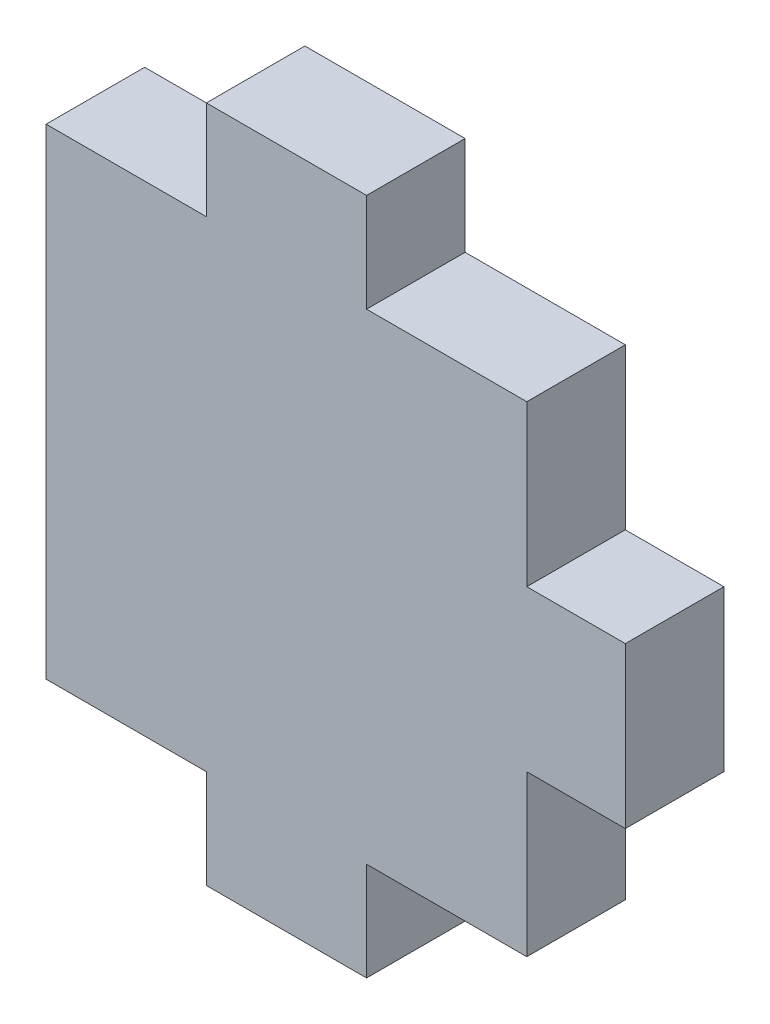
ISO-10303-21;
HEADER;
FILE_DESCRIPTION(('STEP AP214'),'2;1');
FILE_NAME('part.step','',(''),(''),'','','');
FILE_SCHEMA(('AUTOMOTIVE_DESIGN { 1 0 10303 214 1 1 1 1 }'));
ENDSEC;
DATA;
#1=APPLICATION_CONTEXT('core data for automotive mechanical design processes');
#2=APPLICATION_PROTOCOL_DEFINITION('international standard','automotive_design',2000,#1);
#3=PRODUCT_CONTEXT('',#1,'mechanical');
#4=PRODUCT('Part','Part','',(#3));
#5=PRODUCT_RELATED_PRODUCT_CATEGORY('part','',(#4));
#6=PRODUCT_DEFINITION_FORMATION('','',#4);
#7=PRODUCT_DEFINITION_CONTEXT('part definition',#1,'design');
#8=PRODUCT_DEFINITION('design','',#6,#7);
#9=PRODUCT_DEFINITION_SHAPE('','',#8);
#10=(LENGTH_UNIT() NAMED_UNIT(*) SI_UNIT(.MILLI.,.METRE.));
#11=(NAMED_UNIT(*) PLANE_ANGLE_UNIT() SI_UNIT($,.RADIAN.));
#12=(NAMED_UNIT(*) SI_UNIT($,.STERADIAN.) SOLID_ANGLE_UNIT());
#13=UNCERTAINTY_MEASURE_WITH_UNIT(LENGTH_MEASURE(1.E-05),#10,'distance_accuracy_value','');
#14=(GEOMETRIC_REPRESENTATION_CONTEXT(3) GLOBAL_UNCERTAINTY_ASSIGNED_CONTEXT((#13)) GLOBAL_UNIT_ASSIGNED_CONTEXT((#10,
#11,#12)) REPRESENTATION_CONTEXT('',''));
#15=CARTESIAN_POINT('',(0.,0.,0.));
#16=DIRECTION('',(0.,0.,1.));
#17=DIRECTION('',(1.,0.,0.));
#18=AXIS2_PLACEMENT_3D('',#15,#16,#17);
#19=CARTESIAN_POINT('',(-6.14718494021936,17.5053669527158,5.207));
#20=DIRECTION('',(1.,0.,0.));
#21=DIRECTION('',(0.,0.,-1.));
#22=AXIS2_PLACEMENT_3D('',#19,#20,#21);
#23=PLANE('',#22);
#24=DIRECTION('',(0.,-1.,0.));
#25=VECTOR('',#24,1.);
#26=CARTESIAN_POINT('',(-6.14718494021936,17.5053669527158,0.));
#27=LINE('',#26,#25);
#28=CARTESIAN_POINT('',(-6.14718494021936,17.5053669527158,0.));
#29=VERTEX_POINT('',#28);
#30=CARTESIAN_POINT('',(-6.14718494021936,-7.89463304728425,0.));
#31=VERTEX_POINT('',#30);
#32=EDGE_CURVE('E176',#29,#31,#27,.T.);
#33=ORIENTED_EDGE('',*,*,#32,.T.);
#34=DIRECTION('',(0.,0.,-1.));
#35=VECTOR('',#34,1.);
#36=CARTESIAN_POINT('',(-6.14718494021936,-7.89463304728425,5.207));
#37=LINE('',#36,#35);
#38=CARTESIAN_POINT('',(-6.14718494021936,-7.89463304728425,5.207));
#39=VERTEX_POINT('',#38);
#40=EDGE_CURVE('E11',#39,#31,#37,.T.);
#41=ORIENTED_EDGE('',*,*,#40,.F.);
#42=DIRECTION('',(0.,-1.,0.));
#43=VECTOR('',#42,1.);
#44=CARTESIAN_POINT('',(-6.14718494021936,17.5053669527158,5.207));
#45=LINE('',#44,#43);
#46=CARTESIAN_POINT('',(-6.14718494021936,17.5053669527158,5.207));
#47=VERTEX_POINT('',#46);
#48=EDGE_CURVE('E206',#47,#39,#45,.T.);
#49=ORIENTED_EDGE('',*,*,#48,.F.);
#50=DIRECTION('',(0.,0.,-1.));
#51=VECTOR('',#50,1.);
#52=CARTESIAN_POINT('',(-6.14718494021936,17.5053669527158,5.207));
#53=LINE('',#52,#51);
#54=EDGE_CURVE('E172',#47,#29,#53,.T.);
#55=ORIENTED_EDGE('',*,*,#54,.T.);
#56=EDGE_LOOP('',(#33,#41,#49,#55));
#57=FACE_BOUND('',#56,.T.);
#58=ADVANCED_FACE('F32',(#57),#23,.F.);
#59=CARTESIAN_POINT('',(-6.14718494021936,-7.89463304728425,5.207));
#60=DIRECTION('',(0.,1.,0.));
#61=DIRECTION('',(0.,0.,1.));
#62=AXIS2_PLACEMENT_3D('',#59,#60,#61);
#63=PLANE('',#62);
#64=DIRECTION('',(1.,0.,0.));
#65=VECTOR('',#64,1.);
#66=CARTESIAN_POINT('',(-6.14718494021936,-7.89463304728425,0.));
#67=LINE('',#66,#65);
#68=CARTESIAN_POINT('',(2.3194817264473,-7.89463304728425,0.));
#69=VERTEX_POINT('',#68);
#70=EDGE_CURVE('E179',#31,#69,#67,.T.);
#71=ORIENTED_EDGE('',*,*,#70,.T.);
#72=DIRECTION('',(0.,0.,-1.));
#73=VECTOR('',#72,1.);
#74=CARTESIAN_POINT('',(2.3194817264473,-7.89463304728425,5.207));
#75=LINE('',#74,#73);
#76=CARTESIAN_POINT('',(2.3194817264473,-7.89463304728425,5.207));
#77=VERTEX_POINT('',#76);
#78=EDGE_CURVE('E40',#77,#69,#75,.T.);
#79=ORIENTED_EDGE('',*,*,#78,.F.);
#80=DIRECTION('',(1.,0.,0.));
#81=VECTOR('',#80,1.);
#82=CARTESIAN_POINT('',(-6.14718494021936,-7.89463304728425,5.207));
#83=LINE('',#82,#81);
#84=EDGE_CURVE('E115',#39,#77,#83,.T.);
#85=ORIENTED_EDGE('',*,*,#84,.F.);
#86=ORIENTED_EDGE('',*,*,#40,.T.);
#87=EDGE_LOOP('',(#71,#79,#85,#86));
#88=FACE_BOUND('',#87,.T.);
#89=ADVANCED_FACE('F304',(#88),#63,.F.);
#90=CARTESIAN_POINT('',(2.3194817264473,-7.89463304728425,5.207));
#91=DIRECTION('',(1.,0.,0.));
#92=DIRECTION('',(0.,1.,0.));
#93=AXIS2_PLACEMENT_3D('',#90,#91,#92);
#94=PLANE('',#93);
#95=DIRECTION('',(0.,-1.,0.));
#96=VECTOR('',#95,1.);
#97=CARTESIAN_POINT('',(2.3194817264473,-7.89463304728425,0.));
#98=LINE('',#97,#96);
#99=CARTESIAN_POINT('',(2.3194817264473,-13.1016330472842,0.));
#100=VERTEX_POINT('',#99);
#101=EDGE_CURVE('E181',#69,#100,#98,.T.);
#102=ORIENTED_EDGE('',*,*,#101,.T.);
#103=DIRECTION('',(0.,0.,-1.));
#104=VECTOR('',#103,1.);
#105=CARTESIAN_POINT('',(2.3194817264473,-13.1016330472842,5.207));
#106=LINE('',#105,#104);
#107=CARTESIAN_POINT('',(2.3194817264473,-13.1016330472842,5.207));
#108=VERTEX_POINT('',#107);
#109=EDGE_CURVE('E237',#108,#100,#106,.T.);
#110=ORIENTED_EDGE('',*,*,#109,.F.);
#111=DIRECTION('',(0.,-1.,0.));
#112=VECTOR('',#111,1.);
#113=CARTESIAN_POINT('',(2.3194817264473,-7.89463304728425,5.207));
#114=LINE('',#113,#112);
#115=EDGE_CURVE('E245',#77,#108,#114,.T.);
#116=ORIENTED_EDGE('',*,*,#115,.F.);
#117=ORIENTED_EDGE('',*,*,#78,.T.);
#118=EDGE_LOOP('',(#102,#110,#116,#117));
#119=FACE_BOUND('',#118,.T.);
#120=ADVANCED_FACE('F243',(#119),#94,.F.);
#121=CARTESIAN_POINT('',(2.3194817264473,-13.1016330472842,5.207));
#122=DIRECTION('',(0.,1.,0.));
#123=DIRECTION('',(0.,0.,1.));
#124=AXIS2_PLACEMENT_3D('',#121,#122,#123);
#125=PLANE('',#124);
#126=DIRECTION('',(1.,0.,0.));
#127=VECTOR('',#126,1.);
#128=CARTESIAN_POINT('',(2.3194817264473,-13.1016330472842,0.));
#129=LINE('',#128,#127);
#130=CARTESIAN_POINT('',(10.786148393114,-13.1016330472842,0.));
#131=VERTEX_POINT('',#130);
#132=EDGE_CURVE('E183',#100,#131,#129,.T.);
#133=ORIENTED_EDGE('',*,*,#132,.T.);
#134=DIRECTION('',(0.,0.,-1.));
#135=VECTOR('',#134,1.);
#136=CARTESIAN_POINT('',(10.786148393114,-13.1016330472842,5.207));
#137=LINE('',#136,#135);
#138=CARTESIAN_POINT('',(10.786148393114,-13.1016330472842,5.207));
#139=VERTEX_POINT('',#138);
#140=EDGE_CURVE('E234',#139,#131,#137,.T.);
#141=ORIENTED_EDGE('',*,*,#140,.F.);
#142=DIRECTION('',(1.,0.,0.));
#143=VECTOR('',#142,1.);
#144=CARTESIAN_POINT('',(2.3194817264473,-13.1016330472842,5.207));
#145=LINE('',#144,#143);
#146=EDGE_CURVE('E263',#108,#139,#145,.T.);
#147=ORIENTED_EDGE('',*,*,#146,.F.);
#148=ORIENTED_EDGE('',*,*,#109,.T.);
#149=EDGE_LOOP('',(#133,#141,#147,#148));
#150=FACE_BOUND('',#149,.T.);
#151=ADVANCED_FACE('F254',(#150),#125,.F.);
#152=CARTESIAN_POINT('',(10.786148393114,-7.89463304728425,5.207));
#153=DIRECTION('',(-1.,0.,0.));
#154=DIRECTION('',(0.,-1.,0.));
#155=AXIS2_PLACEMENT_3D('',#152,#153,#154);
#156=PLANE('',#155);
#157=DIRECTION('',(0.,1.,0.));
#158=VECTOR('',#157,1.);
#159=CARTESIAN_POINT('',(10.786148393114,-7.89463304728425,0.));
#160=LINE('',#159,#158);
#161=CARTESIAN_POINT('',(10.786148393114,-7.89463304728425,0.));
#162=VERTEX_POINT('',#161);
#163=EDGE_CURVE('E185',#131,#162,#160,.T.);
#164=ORIENTED_EDGE('',*,*,#163,.T.);
#165=DIRECTION('',(0.,0.,-1.));
#166=VECTOR('',#165,1.);
#167=CARTESIAN_POINT('',(10.786148393114,-7.89463304728425,5.207));
#168=LINE('',#167,#166);
#169=CARTESIAN_POINT('',(10.786148393114,-7.89463304728425,5.207));
#170=VERTEX_POINT('',#169);
#171=EDGE_CURVE('E231',#170,#162,#168,.T.);
#172=ORIENTED_EDGE('',*,*,#171,.F.);
#173=DIRECTION('',(0.,1.,0.));
#174=VECTOR('',#173,1.);
#175=CARTESIAN_POINT('',(10.786148393114,-7.89463304728425,5.207));
#176=LINE('',#175,#174);
#177=EDGE_CURVE('E260',#139,#170,#176,.T.);
#178=ORIENTED_EDGE('',*,*,#177,.F.);
#179=ORIENTED_EDGE('',*,*,#140,.T.);
#180=EDGE_LOOP('',(#164,#172,#178,#179));
#181=FACE_BOUND('',#180,.T.);
#182=ADVANCED_FACE('F258',(#181),#156,.F.);
#183=CARTESIAN_POINT('',(10.786148393114,-7.89463304728425,5.207));
#184=DIRECTION('',(0.,1.,0.));
#185=DIRECTION('',(0.,0.,1.));
#186=AXIS2_PLACEMENT_3D('',#183,#184,#185);
#187=PLANE('',#186);
#188=DIRECTION('',(1.,0.,0.));
#189=VECTOR('',#188,1.);
#190=CARTESIAN_POINT('',(10.786148393114,-7.89463304728425,0.));
#191=LINE('',#190,#189);
#192=CARTESIAN_POINT('',(19.2528150597806,-7.89463304728425,0.));
#193=VERTEX_POINT('',#192);
#194=EDGE_CURVE('E187',#162,#193,#191,.T.);
#195=ORIENTED_EDGE('',*,*,#194,.T.);
#196=DIRECTION('',(0.,0.,-1.));
#197=VECTOR('',#196,1.);
#198=CARTESIAN_POINT('',(19.2528150597806,-7.89463304728425,5.207));
#199=LINE('',#198,#197);
#200=CARTESIAN_POINT('',(19.2528150597806,-7.89463304728425,5.207));
#201=VERTEX_POINT('',#200);
#202=EDGE_CURVE('E228',#201,#193,#199,.T.);
#203=ORIENTED_EDGE('',*,*,#202,.F.);
#204=DIRECTION('',(1.,0.,0.));
#205=VECTOR('',#204,1.);
#206=CARTESIAN_POINT('',(10.786148393114,-7.89463304728425,5.207));
#207=LINE('',#206,#205);
#208=EDGE_CURVE('E262',#170,#201,#207,.T.);
#209=ORIENTED_EDGE('',*,*,#208,.F.);
#210=ORIENTED_EDGE('',*,*,#171,.T.);
#211=EDGE_LOOP('',(#195,#203,#209,#210));
#212=FACE_BOUND('',#211,.T.);
#213=ADVANCED_FACE('F317',(#212),#187,.F.);
#214=CARTESIAN_POINT('',(19.2528150597806,0.572033619382422,5.207));
#215=DIRECTION('',(-1.,0.,0.));
#216=DIRECTION('',(0.,0.,1.));
#217=AXIS2_PLACEMENT_3D('',#214,#215,#216);
#218=PLANE('',#217);
#219=DIRECTION('',(0.,1.,0.));
#220=VECTOR('',#219,1.);
#221=CARTESIAN_POINT('',(19.2528150597806,0.572033619382422,0.));
#222=LINE('',#221,#220);
#223=CARTESIAN_POINT('',(19.2528150597806,0.572033619382422,0.));
#224=VERTEX_POINT('',#223);
#225=EDGE_CURVE('E189',#193,#224,#222,.T.);
#226=ORIENTED_EDGE('',*,*,#225,.T.);
#227=DIRECTION('',(0.,0.,-1.));
#228=VECTOR('',#227,1.);
#229=CARTESIAN_POINT('',(19.2528150597806,0.572033619382422,5.207));
#230=LINE('',#229,#228);
#231=CARTESIAN_POINT('',(19.2528150597806,0.572033619382422,5.207));
#232=VERTEX_POINT('',#231);
#233=EDGE_CURVE('E225',#232,#224,#230,.T.);
#234=ORIENTED_EDGE('',*,*,#233,.F.);
#235=DIRECTION('',(0.,1.,0.));
#236=VECTOR('',#235,1.);
#237=CARTESIAN_POINT('',(19.2528150597806,0.572033619382422,5.207));
#238=LINE('',#237,#236);
#239=EDGE_CURVE('E265',#201,#232,#238,.T.);
#240=ORIENTED_EDGE('',*,*,#239,.F.);
#241=ORIENTED_EDGE('',*,*,#202,.T.);
#242=EDGE_LOOP('',(#226,#234,#240,#241));
#243=FACE_BOUND('',#242,.T.);
#244=ADVANCED_FACE('F320',(#243),#218,.F.);
#245=CARTESIAN_POINT('',(19.2528150597806,0.572033619382422,5.207));
#246=DIRECTION('',(0.,1.,0.));
#247=DIRECTION('',(0.,0.,1.));
#248=AXIS2_PLACEMENT_3D('',#245,#246,#247);
#249=PLANE('',#248);
#250=DIRECTION('',(1.,0.,0.));
#251=VECTOR('',#250,1.);
#252=CARTESIAN_POINT('',(19.2528150597806,0.572033619382422,0.));
#253=LINE('',#252,#251);
#254=CARTESIAN_POINT('',(24.4598150597806,0.572033619382422,0.));
#255=VERTEX_POINT('',#254);
#256=EDGE_CURVE('E191',#224,#255,#253,.T.);
#257=ORIENTED_EDGE('',*,*,#256,.T.);
#258=DIRECTION('',(0.,0.,-1.));
#259=VECTOR('',#258,1.);
#260=CARTESIAN_POINT('',(24.4598150597806,0.572033619382422,5.207));
#261=LINE('',#260,#259);
#262=CARTESIAN_POINT('',(24.4598150597806,0.572033619382422,5.207));
#263=VERTEX_POINT('',#262);
#264=EDGE_CURVE('E222',#263,#255,#261,.T.);
#265=ORIENTED_EDGE('',*,*,#264,.F.);
#266=DIRECTION('',(1.,0.,0.));
#267=VECTOR('',#266,1.);
#268=CARTESIAN_POINT('',(19.2528150597806,0.572033619382422,5.207));
#269=LINE('',#268,#267);
#270=EDGE_CURVE('E271',#232,#263,#269,.T.);
#271=ORIENTED_EDGE('',*,*,#270,.F.);
#272=ORIENTED_EDGE('',*,*,#233,.T.);
#273=EDGE_LOOP('',(#257,#265,#271,#272));
#274=FACE_BOUND('',#273,.T.);
#275=ADVANCED_FACE('F324',(#274),#249,.F.);
#276=CARTESIAN_POINT('',(24.4598150597806,9.03870028604909,5.207));
#277=DIRECTION('',(-1.,0.,0.));
#278=DIRECTION('',(0.,0.,1.));
#279=AXIS2_PLACEMENT_3D('',#276,#277,#278);
#280=PLANE('',#279);
#281=DIRECTION('',(0.,1.,0.));
#282=VECTOR('',#281,1.);
#283=CARTESIAN_POINT('',(24.4598150597806,9.03870028604909,0.));
#284=LINE('',#283,#282);
#285=CARTESIAN_POINT('',(24.4598150597806,9.03870028604909,0.));
#286=VERTEX_POINT('',#285);
#287=EDGE_CURVE('E193',#255,#286,#284,.T.);
#288=ORIENTED_EDGE('',*,*,#287,.T.);
#289=DIRECTION('',(0.,0.,-1.));
#290=VECTOR('',#289,1.);
#291=CARTESIAN_POINT('',(24.4598150597806,9.03870028604909,5.207));
#292=LINE('',#291,#290);
#293=CARTESIAN_POINT('',(24.4598150597806,9.03870028604909,5.207));
#294=VERTEX_POINT('',#293);
#295=EDGE_CURVE('E219',#294,#286,#292,.T.);
#296=ORIENTED_EDGE('',*,*,#295,.F.);
#297=DIRECTION('',(0.,1.,0.));
#298=VECTOR('',#297,1.);
#299=CARTESIAN_POINT('',(24.4598150597806,9.03870028604909,5.207));
#300=LINE('',#299,#298);
#301=EDGE_CURVE('E273',#263,#294,#300,.T.);
#302=ORIENTED_EDGE('',*,*,#301,.F.);
#303=ORIENTED_EDGE('',*,*,#264,.T.);
#304=EDGE_LOOP('',(#288,#296,#302,#303));
#305=FACE_BOUND('',#304,.T.);
#306=ADVANCED_FACE('F328',(#305),#280,.F.);
#307=CARTESIAN_POINT('',(19.2528150597806,9.03870028604909,5.207));
#308=DIRECTION('',(0.,-1.,0.));
#309=DIRECTION('',(0.,0.,-1.));
#310=AXIS2_PLACEMENT_3D('',#307,#308,#309);
#311=PLANE('',#310);
#312=DIRECTION('',(-1.,0.,0.));
#313=VECTOR('',#312,1.);
#314=CARTESIAN_POINT('',(19.2528150597806,9.03870028604909,0.));
#315=LINE('',#314,#313);
#316=CARTESIAN_POINT('',(19.2528150597806,9.03870028604909,0.));
#317=VERTEX_POINT('',#316);
#318=EDGE_CURVE('E195',#286,#317,#315,.T.);
#319=ORIENTED_EDGE('',*,*,#318,.T.);
#320=DIRECTION('',(0.,0.,-1.));
#321=VECTOR('',#320,1.);
#322=CARTESIAN_POINT('',(19.2528150597806,9.03870028604909,5.207));
#323=LINE('',#322,#321);
#324=CARTESIAN_POINT('',(19.2528150597806,9.03870028604909,5.207));
#325=VERTEX_POINT('',#324);
#326=EDGE_CURVE('E216',#325,#317,#323,.T.);
#327=ORIENTED_EDGE('',*,*,#326,.F.);
#328=DIRECTION('',(-1.,0.,0.));
#329=VECTOR('',#328,1.);
#330=CARTESIAN_POINT('',(19.2528150597806,9.03870028604909,5.207));
#331=LINE('',#330,#329);
#332=EDGE_CURVE('E275',#294,#325,#331,.T.);
#333=ORIENTED_EDGE('',*,*,#332,.F.);
#334=ORIENTED_EDGE('',*,*,#295,.T.);
#335=EDGE_LOOP('',(#319,#327,#333,#334));
#336=FACE_BOUND('',#335,.T.);
#337=ADVANCED_FACE('F332',(#336),#311,.F.);
#338=CARTESIAN_POINT('',(19.2528150597806,17.5053669527158,5.207));
#339=DIRECTION('',(-1.,0.,0.));
#340=DIRECTION('',(0.,0.,1.));
#341=AXIS2_PLACEMENT_3D('',#338,#339,#340);
#342=PLANE('',#341);
#343=DIRECTION('',(0.,1.,0.));
#344=VECTOR('',#343,1.);
#345=CARTESIAN_POINT('',(19.2528150597806,17.5053669527158,0.));
#346=LINE('',#345,#344);
#347=CARTESIAN_POINT('',(19.2528150597806,17.5053669527158,0.));
#348=VERTEX_POINT('',#347);
#349=EDGE_CURVE('E197',#317,#348,#346,.T.);
#350=ORIENTED_EDGE('',*,*,#349,.T.);
#351=DIRECTION('',(0.,0.,-1.));
#352=VECTOR('',#351,1.);
#353=CARTESIAN_POINT('',(19.2528150597806,17.5053669527158,5.207));
#354=LINE('',#353,#352);
#355=CARTESIAN_POINT('',(19.2528150597806,17.5053669527158,5.207));
#356=VERTEX_POINT('',#355);
#357=EDGE_CURVE('E213',#356,#348,#354,.T.);
#358=ORIENTED_EDGE('',*,*,#357,.F.);
#359=DIRECTION('',(0.,1.,0.));
#360=VECTOR('',#359,1.);
#361=CARTESIAN_POINT('',(19.2528150597806,17.5053669527158,5.207));
#362=LINE('',#361,#360);
#363=EDGE_CURVE('E277',#325,#356,#362,.T.);
#364=ORIENTED_EDGE('',*,*,#363,.F.);
#365=ORIENTED_EDGE('',*,*,#326,.T.);
#366=EDGE_LOOP('',(#350,#358,#364,#365));
#367=FACE_BOUND('',#366,.T.);
#368=ADVANCED_FACE('F336',(#367),#342,.F.);
#369=CARTESIAN_POINT('',(10.786148393114,17.5053669527158,5.207));
#370=DIRECTION('',(0.,-1.,0.));
#371=DIRECTION('',(0.,0.,-1.));
#372=AXIS2_PLACEMENT_3D('',#369,#370,#371);
#373=PLANE('',#372);
#374=DIRECTION('',(-1.,0.,0.));
#375=VECTOR('',#374,1.);
#376=CARTESIAN_POINT('',(10.786148393114,17.5053669527158,0.));
#377=LINE('',#376,#375);
#378=CARTESIAN_POINT('',(10.786148393114,17.5053669527158,0.));
#379=VERTEX_POINT('',#378);
#380=EDGE_CURVE('E199',#348,#379,#377,.T.);
#381=ORIENTED_EDGE('',*,*,#380,.T.);
#382=DIRECTION('',(0.,0.,-1.));
#383=VECTOR('',#382,1.);
#384=CARTESIAN_POINT('',(10.786148393114,17.5053669527158,5.207));
#385=LINE('',#384,#383);
#386=CARTESIAN_POINT('',(10.786148393114,17.5053669527158,5.207));
#387=VERTEX_POINT('',#386);
#388=EDGE_CURVE('E210',#387,#379,#385,.T.);
#389=ORIENTED_EDGE('',*,*,#388,.F.);
#390=DIRECTION('',(-1.,0.,0.));
#391=VECTOR('',#390,1.);
#392=CARTESIAN_POINT('',(10.786148393114,17.5053669527158,5.207));
#393=LINE('',#392,#391);
#394=EDGE_CURVE('E279',#356,#387,#393,.T.);
#395=ORIENTED_EDGE('',*,*,#394,.F.);
#396=ORIENTED_EDGE('',*,*,#357,.T.);
#397=EDGE_LOOP('',(#381,#389,#395,#396));
#398=FACE_BOUND('',#397,.T.);
#399=ADVANCED_FACE('F285',(#398),#373,.F.);
#400=CARTESIAN_POINT('',(10.786148393114,17.5053669527158,5.207));
#401=DIRECTION('',(-1.,0.,0.));
#402=DIRECTION('',(0.,0.,1.));
#403=AXIS2_PLACEMENT_3D('',#400,#401,#402);
#404=PLANE('',#403);
#405=DIRECTION('',(0.,1.,0.));
#406=VECTOR('',#405,1.);
#407=CARTESIAN_POINT('',(10.786148393114,17.5053669527158,0.));
#408=LINE('',#407,#406);
#409=CARTESIAN_POINT('',(10.786148393114,22.7123669527158,0.));
#410=VERTEX_POINT('',#409);
#411=EDGE_CURVE('E201',#379,#410,#408,.T.);
#412=ORIENTED_EDGE('',*,*,#411,.T.);
#413=DIRECTION('',(0.,0.,-1.));
#414=VECTOR('',#413,1.);
#415=CARTESIAN_POINT('',(10.786148393114,22.7123669527158,5.207));
#416=LINE('',#415,#414);
#417=CARTESIAN_POINT('',(10.786148393114,22.7123669527158,5.207));
#418=VERTEX_POINT('',#417);
#419=EDGE_CURVE('E167',#418,#410,#416,.T.);
#420=ORIENTED_EDGE('',*,*,#419,.F.);
#421=DIRECTION('',(0.,1.,0.));
#422=VECTOR('',#421,1.);
#423=CARTESIAN_POINT('',(10.786148393114,17.5053669527158,5.207));
#424=LINE('',#423,#422);
#425=EDGE_CURVE('E158',#387,#418,#424,.T.);
#426=ORIENTED_EDGE('',*,*,#425,.F.);
#427=ORIENTED_EDGE('',*,*,#388,.T.);
#428=EDGE_LOOP('',(#412,#420,#426,#427));
#429=FACE_BOUND('',#428,.T.);
#430=ADVANCED_FACE('F289',(#429),#404,.F.);
#431=CARTESIAN_POINT('',(2.3194817264473,22.7123669527158,5.207));
#432=DIRECTION('',(0.,-1.,0.));
#433=DIRECTION('',(0.,0.,-1.));
#434=AXIS2_PLACEMENT_3D('',#431,#432,#433);
#435=PLANE('',#434);
#436=DIRECTION('',(-1.,0.,0.));
#437=VECTOR('',#436,1.);
#438=CARTESIAN_POINT('',(2.3194817264473,22.7123669527158,0.));
#439=LINE('',#438,#437);
#440=CARTESIAN_POINT('',(2.3194817264473,22.7123669527158,0.));
#441=VERTEX_POINT('',#440);
#442=EDGE_CURVE('E166',#410,#441,#439,.T.);
#443=ORIENTED_EDGE('',*,*,#442,.T.);
#444=DIRECTION('',(0.,0.,-1.));
#445=VECTOR('',#444,1.);
#446=CARTESIAN_POINT('',(2.3194817264473,22.7123669527158,5.207));
#447=LINE('',#446,#445);
#448=CARTESIAN_POINT('',(2.3194817264473,22.7123669527158,5.207));
#449=VERTEX_POINT('',#448);
#450=EDGE_CURVE('E163',#449,#441,#447,.T.);
#451=ORIENTED_EDGE('',*,*,#450,.F.);
#452=DIRECTION('',(-1.,0.,0.));
#453=VECTOR('',#452,1.);
#454=CARTESIAN_POINT('',(2.3194817264473,22.7123669527158,5.207));
#455=LINE('',#454,#453);
#456=EDGE_CURVE('E152',#418,#449,#455,.T.);
#457=ORIENTED_EDGE('',*,*,#456,.F.);
#458=ORIENTED_EDGE('',*,*,#419,.T.);
#459=EDGE_LOOP('',(#443,#451,#457,#458));
#460=FACE_BOUND('',#459,.T.);
#461=ADVANCED_FACE('F164',(#460),#435,.F.);
#462=CARTESIAN_POINT('',(2.31948172644731,17.5053669527158,5.207));
#463=DIRECTION('',(1.,0.,0.));
#464=DIRECTION('',(0.,1.,0.));
#465=AXIS2_PLACEMENT_3D('',#462,#463,#464);
#466=PLANE('',#465);
#467=DIRECTION('',(0.,-1.,0.));
#468=VECTOR('',#467,1.);
#469=CARTESIAN_POINT('',(2.31948172644731,17.5053669527158,0.));
#470=LINE('',#469,#468);
#471=CARTESIAN_POINT('',(2.31948172644731,17.5053669527158,0.));
#472=VERTEX_POINT('',#471);
#473=EDGE_CURVE('E101',#441,#472,#470,.T.);
#474=ORIENTED_EDGE('',*,*,#473,.T.);
#475=DIRECTION('',(0.,0.,-1.));
#476=VECTOR('',#475,1.);
#477=CARTESIAN_POINT('',(2.31948172644731,17.5053669527158,5.207));
#478=LINE('',#477,#476);
#479=CARTESIAN_POINT('',(2.31948172644731,17.5053669527158,5.207));
#480=VERTEX_POINT('',#479);
#481=EDGE_CURVE('E168',#480,#472,#478,.T.);
#482=ORIENTED_EDGE('',*,*,#481,.F.);
#483=DIRECTION('',(0.,-1.,0.));
#484=VECTOR('',#483,1.);
#485=CARTESIAN_POINT('',(2.31948172644731,17.5053669527158,5.207));
#486=LINE('',#485,#484);
#487=EDGE_CURVE('E156',#449,#480,#486,.T.);
#488=ORIENTED_EDGE('',*,*,#487,.F.);
#489=ORIENTED_EDGE('',*,*,#450,.T.);
#490=EDGE_LOOP('',(#474,#482,#488,#489));
#491=FACE_BOUND('',#490,.T.);
#492=ADVANCED_FACE('F170',(#491),#466,.F.);
#493=CARTESIAN_POINT('',(-6.14718494021936,17.5053669527158,5.207));
#494=DIRECTION('',(0.,-1.,0.));
#495=DIRECTION('',(0.,0.,-1.));
#496=AXIS2_PLACEMENT_3D('',#493,#494,#495);
#497=PLANE('',#496);
#498=DIRECTION('',(-1.,0.,0.));
#499=VECTOR('',#498,1.);
#500=CARTESIAN_POINT('',(-6.14718494021936,17.5053669527158,0.));
#501=LINE('',#500,#499);
#502=EDGE_CURVE('E107',#472,#29,#501,.T.);
#503=ORIENTED_EDGE('',*,*,#502,.T.);
#504=ORIENTED_EDGE('',*,*,#54,.F.);
#505=DIRECTION('',(-1.,0.,0.));
#506=VECTOR('',#505,1.);
#507=CARTESIAN_POINT('',(-6.14718494021936,17.5053669527158,5.207));
#508=LINE('',#507,#506);
#509=EDGE_CURVE('E48',#480,#47,#508,.T.);
#510=ORIENTED_EDGE('',*,*,#509,.F.);
#511=ORIENTED_EDGE('',*,*,#481,.T.);
#512=EDGE_LOOP('',(#503,#504,#510,#511));
#513=FACE_BOUND('',#512,.T.);
#514=ADVANCED_FACE('F293',(#513),#497,.F.);
#515=CARTESIAN_POINT('',(0.,0.,5.207));
#516=DIRECTION('',(0.,0.,1.));
#517=DIRECTION('',(1.,0.,0.));
#518=AXIS2_PLACEMENT_3D('',#515,#516,#517);
#519=PLANE('',#518);
#520=ORIENTED_EDGE('',*,*,#48,.T.);
#521=ORIENTED_EDGE('',*,*,#84,.T.);
#522=ORIENTED_EDGE('',*,*,#115,.T.);
#523=ORIENTED_EDGE('',*,*,#146,.T.);
#524=ORIENTED_EDGE('',*,*,#177,.T.);
#525=ORIENTED_EDGE('',*,*,#208,.T.);
#526=ORIENTED_EDGE('',*,*,#239,.T.);
#527=ORIENTED_EDGE('',*,*,#270,.T.);
#528=ORIENTED_EDGE('',*,*,#301,.T.);
#529=ORIENTED_EDGE('',*,*,#332,.T.);
#530=ORIENTED_EDGE('',*,*,#363,.T.);
#531=ORIENTED_EDGE('',*,*,#394,.T.);
#532=ORIENTED_EDGE('',*,*,#425,.T.);
#533=ORIENTED_EDGE('',*,*,#456,.T.);
#534=ORIENTED_EDGE('',*,*,#487,.T.);
#535=ORIENTED_EDGE('',*,*,#509,.T.);
#536=EDGE_LOOP('',(#520,#521,#522,#523,#524,#525,#526,#527,#528,#529,#530,#531,#532,#533,#534,#535));
#537=FACE_BOUND('',#536,.T.);
#538=ADVANCED_FACE('F154',(#537),#519,.T.);
#539=CARTESIAN_POINT('',(0.,0.,0.));
#540=DIRECTION('',(0.,0.,1.));
#541=DIRECTION('',(1.,0.,0.));
#542=AXIS2_PLACEMENT_3D('',#539,#540,#541);
#543=PLANE('',#542);
#544=ORIENTED_EDGE('',*,*,#32,.F.);
#545=ORIENTED_EDGE('',*,*,#502,.F.);
#546=ORIENTED_EDGE('',*,*,#473,.F.);
#547=ORIENTED_EDGE('',*,*,#442,.F.);
#548=ORIENTED_EDGE('',*,*,#411,.F.);
#549=ORIENTED_EDGE('',*,*,#380,.F.);
#550=ORIENTED_EDGE('',*,*,#349,.F.);
#551=ORIENTED_EDGE('',*,*,#318,.F.);
#552=ORIENTED_EDGE('',*,*,#287,.F.);
#553=ORIENTED_EDGE('',*,*,#256,.F.);
#554=ORIENTED_EDGE('',*,*,#225,.F.);
#555=ORIENTED_EDGE('',*,*,#194,.F.);
#556=ORIENTED_EDGE('',*,*,#163,.F.);
#557=ORIENTED_EDGE('',*,*,#132,.F.);
#558=ORIENTED_EDGE('',*,*,#101,.F.);
#559=ORIENTED_EDGE('',*,*,#70,.F.);
#560=EDGE_LOOP('',(#544,#545,#546,#547,#548,#549,#550,#551,#552,#553,#554,#555,#556,#557,#558,#559));
#561=FACE_BOUND('',#560,.T.);
#562=ADVANCED_FACE('F249',(#561),#543,.F.);
#563=CLOSED_SHELL('',(#58,#89,#120,#151,#182,#213,#244,#275,#306,#337,#368,#399,#430,#461,#492,
#514,#538,#562));
#564=MANIFOLD_SOLID_BREP('B2',#563);
#565=ADVANCED_BREP_SHAPE_REPRESENTATION('',(#18,#564),#14);
#566=SHAPE_DEFINITION_REPRESENTATION(#9,#565);
ENDSEC;
END-ISO-10303-21;
